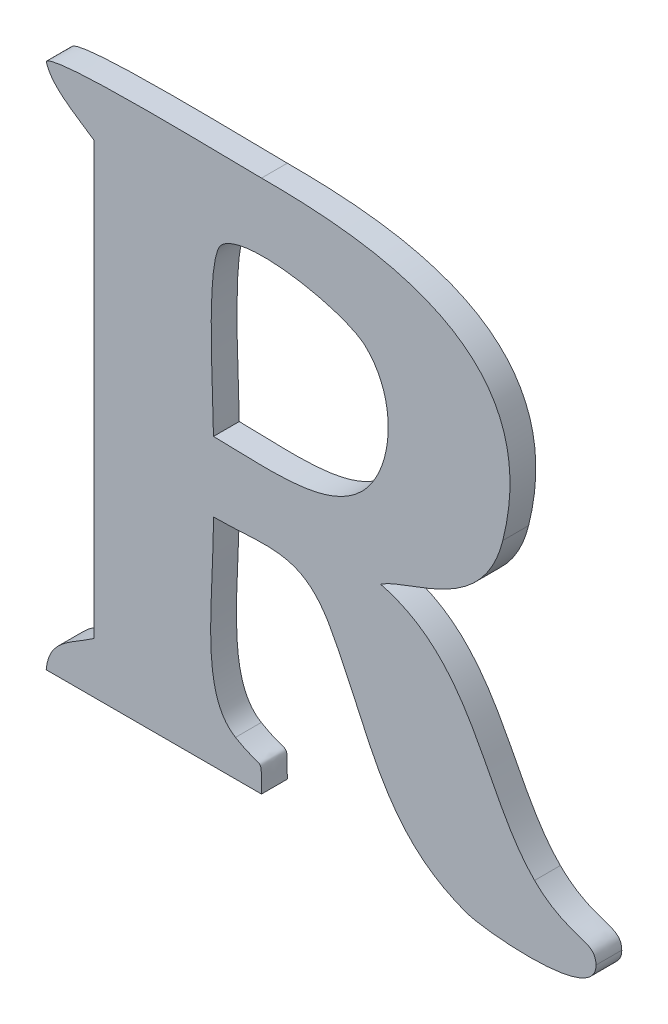
ISO-10303-21;
HEADER;
FILE_DESCRIPTION(('STEP AP214'),'2;1');
FILE_NAME('part.step','',(''),(''),'','','');
FILE_SCHEMA(('AUTOMOTIVE_DESIGN { 1 0 10303 214 1 1 1 1 }'));
ENDSEC;
DATA;
#1=APPLICATION_CONTEXT('core data for automotive mechanical design processes');
#2=APPLICATION_PROTOCOL_DEFINITION('international standard','automotive_design',2000,#1);
#3=PRODUCT_CONTEXT('',#1,'mechanical');
#4=PRODUCT('Part','Part','',(#3));
#5=PRODUCT_RELATED_PRODUCT_CATEGORY('part','',(#4));
#6=PRODUCT_DEFINITION_FORMATION('','',#4);
#7=PRODUCT_DEFINITION_CONTEXT('part definition',#1,'design');
#8=PRODUCT_DEFINITION('design','',#6,#7);
#9=PRODUCT_DEFINITION_SHAPE('','',#8);
#10=(LENGTH_UNIT() NAMED_UNIT(*) SI_UNIT(.MILLI.,.METRE.));
#11=(NAMED_UNIT(*) PLANE_ANGLE_UNIT() SI_UNIT($,.RADIAN.));
#12=(NAMED_UNIT(*) SI_UNIT($,.STERADIAN.) SOLID_ANGLE_UNIT());
#13=UNCERTAINTY_MEASURE_WITH_UNIT(LENGTH_MEASURE(1.E-05),#10,'distance_accuracy_value','');
#14=(GEOMETRIC_REPRESENTATION_CONTEXT(3) GLOBAL_UNCERTAINTY_ASSIGNED_CONTEXT((#13)) GLOBAL_UNIT_ASSIGNED_CONTEXT((#10,
#11,#12)) REPRESENTATION_CONTEXT('',''));
#15=CARTESIAN_POINT('',(0.,0.,0.));
#16=DIRECTION('',(0.,0.,1.));
#17=DIRECTION('',(1.,0.,0.));
#18=AXIS2_PLACEMENT_3D('',#15,#16,#17);
#19=CARTESIAN_POINT('',(50.2016439999998,11.212435,0.001));
#20=CARTESIAN_POINT('',(50.2016439999998,11.212435,0.));
#21=CARTESIAN_POINT('',(50.2033939999998,11.219393,0.001));
#22=CARTESIAN_POINT('',(50.2033939999998,11.219393,0.));
#23=CARTESIAN_POINT('',(50.1965339999998,11.219925,0.001));
#24=CARTESIAN_POINT('',(50.1965339999998,11.219925,0.));
#25=CARTESIAN_POINT('',(50.1922919999998,11.219925,0.001));
#26=CARTESIAN_POINT('',(50.1922919999998,11.219925,0.));
#27=B_SPLINE_SURFACE_WITH_KNOTS('',3,1,((#19,#20),(#21,#22),(#23,#24),(#25,#26)),.UNSPECIFIED.,
.F.,.F.,.F.,(4,4),(2,2),(0.8,0.866666666666667),(0.,1.),.UNSPECIFIED.);
#28=CARTESIAN_POINT('',(50.2016439999998,11.212435,0.));
#29=CARTESIAN_POINT('',(50.2033939999998,11.219393,0.));
#30=CARTESIAN_POINT('',(50.1965339999998,11.219925,0.));
#31=CARTESIAN_POINT('',(50.1922919999998,11.219925,0.));
#32=B_SPLINE_CURVE_WITH_KNOTS('',3,(#28,#29,#30,#31),.UNSPECIFIED.,.F.,.F.,(4,4),(0.8,
0.866666666666667),.UNSPECIFIED.);
#33=CARTESIAN_POINT('',(50.2016439999998,11.212435,0.));
#34=VERTEX_POINT('',#33);
#35=CARTESIAN_POINT('',(50.1922919999998,11.219925,0.));
#36=VERTEX_POINT('',#35);
#37=EDGE_CURVE('E11',#34,#36,#32,.T.);
#38=DIRECTION('',(0.,0.,-1.));
#39=VECTOR('',#38,1.);
#40=CARTESIAN_POINT('',(50.1922919999998,11.219925,0.001));
#41=LINE('',#40,#39);
#42=CARTESIAN_POINT('',(50.1922919999998,11.219925,0.001));
#43=VERTEX_POINT('',#42);
#44=EDGE_CURVE('E28',#43,#36,#41,.T.);
#45=CARTESIAN_POINT('',(50.2016439999998,11.212435,0.001));
#46=CARTESIAN_POINT('',(50.2033939999998,11.219393,0.001));
#47=CARTESIAN_POINT('',(50.1965339999998,11.219925,0.001));
#48=CARTESIAN_POINT('',(50.1922919999998,11.219925,0.001));
#49=B_SPLINE_CURVE_WITH_KNOTS('',3,(#45,#46,#47,#48),.UNSPECIFIED.,.F.,.F.,(4,4),(0.8,
0.866666666666667),.UNSPECIFIED.);
#50=CARTESIAN_POINT('',(50.2016439999998,11.212435,0.001));
#51=VERTEX_POINT('',#50);
#52=EDGE_CURVE('E420',#51,#43,#49,.T.);
#53=DIRECTION('',(0.,0.,-1.));
#54=VECTOR('',#53,1.);
#55=CARTESIAN_POINT('',(50.2016439999998,11.212435,0.001));
#56=LINE('',#55,#54);
#57=EDGE_CURVE('E40',#51,#34,#56,.T.);
#58=ORIENTED_EDGE('',*,*,#37,.T.);
#59=ORIENTED_EDGE('',*,*,#44,.F.);
#60=ORIENTED_EDGE('',*,*,#52,.F.);
#61=ORIENTED_EDGE('',*,*,#57,.T.);
#62=EDGE_LOOP('',(#58,#59,#60,#61));
#63=FACE_BOUND('',#62,.T.);
#64=ADVANCED_FACE('F17',(#63),#27,.F.);
#65=CARTESIAN_POINT('',(50.1922919999998,11.219925,0.001));
#66=CARTESIAN_POINT('',(50.1922919999998,11.219925,0.));
#67=CARTESIAN_POINT('',(50.1910599999998,11.219925,0.001));
#68=CARTESIAN_POINT('',(50.1910599999998,11.219925,0.));
#69=CARTESIAN_POINT('',(50.1843539999998,11.220135,0.001));
#70=CARTESIAN_POINT('',(50.1843539999998,11.220135,0.));
#71=CARTESIAN_POINT('',(50.1839479999998,11.219673,0.001));
#72=CARTESIAN_POINT('',(50.1839479999998,11.219673,0.));
#73=B_SPLINE_SURFACE_WITH_KNOTS('',3,1,((#65,#66),(#67,#68),(#69,#70),(#71,#72)),.UNSPECIFIED.,
.F.,.F.,.F.,(4,4),(2,2),(0.866666666666667,1.),(0.,1.),.UNSPECIFIED.);
#74=CARTESIAN_POINT('',(50.1922919999998,11.219925,0.));
#75=CARTESIAN_POINT('',(50.1910599999998,11.219925,0.));
#76=CARTESIAN_POINT('',(50.1843539999998,11.220135,0.));
#77=CARTESIAN_POINT('',(50.1839479999998,11.219673,0.));
#78=B_SPLINE_CURVE_WITH_KNOTS('',3,(#74,#75,#76,#77),.UNSPECIFIED.,.F.,.F.,(4,4),
(0.866666666666667,1.),.UNSPECIFIED.);
#79=CARTESIAN_POINT('',(50.1839479999998,11.219673,0.));
#80=VERTEX_POINT('',#79);
#81=EDGE_CURVE('E412',#36,#80,#78,.T.);
#82=DIRECTION('',(0.,0.,-1.));
#83=VECTOR('',#82,1.);
#84=CARTESIAN_POINT('',(50.1839479999998,11.219673,0.001));
#85=LINE('',#84,#83);
#86=CARTESIAN_POINT('',(50.1839479999998,11.219673,0.001));
#87=VERTEX_POINT('',#86);
#88=EDGE_CURVE('E407',#87,#80,#85,.T.);
#89=CARTESIAN_POINT('',(50.1922919999998,11.219925,0.001));
#90=CARTESIAN_POINT('',(50.1910599999998,11.219925,0.001));
#91=CARTESIAN_POINT('',(50.1843539999998,11.220135,0.001));
#92=CARTESIAN_POINT('',(50.1839479999998,11.219673,0.001));
#93=B_SPLINE_CURVE_WITH_KNOTS('',3,(#89,#90,#91,#92),.UNSPECIFIED.,.F.,.F.,(4,4),
(0.866666666666667,1.),.UNSPECIFIED.);
#94=EDGE_CURVE('E400',#43,#87,#93,.T.);
#95=ORIENTED_EDGE('',*,*,#81,.T.);
#96=ORIENTED_EDGE('',*,*,#88,.F.);
#97=ORIENTED_EDGE('',*,*,#94,.F.);
#98=ORIENTED_EDGE('',*,*,#44,.T.);
#99=EDGE_LOOP('',(#95,#96,#97,#98));
#100=FACE_BOUND('',#99,.T.);
#101=ADVANCED_FACE('F430',(#100),#73,.F.);
#102=CARTESIAN_POINT('',(50.1839479999998,11.219673,0.001));
#103=CARTESIAN_POINT('',(50.1839479999998,11.219673,0.));
#104=CARTESIAN_POINT('',(50.1841439999998,11.218931,0.001));
#105=CARTESIAN_POINT('',(50.1841439999998,11.218931,0.));
#106=CARTESIAN_POINT('',(50.1851659999998,11.218399,0.001));
#107=CARTESIAN_POINT('',(50.1851659999998,11.218399,0.));
#108=CARTESIAN_POINT('',(50.1857959999998,11.217951,0.001));
#109=CARTESIAN_POINT('',(50.1857959999998,11.217951,0.));
#110=B_SPLINE_SURFACE_WITH_KNOTS('',3,1,((#102,#103),(#104,#105),(#106,#107),(#108,#109)),
.UNSPECIFIED.,.F.,.F.,.F.,(4,4),(2,2),(0.,0.0666666666666667),(0.,1.),.UNSPECIFIED.);
#111=CARTESIAN_POINT('',(50.1839479999998,11.219673,0.));
#112=CARTESIAN_POINT('',(50.1841439999998,11.218931,0.));
#113=CARTESIAN_POINT('',(50.1851659999998,11.218399,0.));
#114=CARTESIAN_POINT('',(50.1857959999998,11.217951,0.));
#115=B_SPLINE_CURVE_WITH_KNOTS('',3,(#111,#112,#113,#114),.UNSPECIFIED.,.F.,.F.,(4,4),(0.,
0.0666666666666667),.UNSPECIFIED.);
#116=CARTESIAN_POINT('',(50.1857959999998,11.217951,0.));
#117=VERTEX_POINT('',#116);
#118=EDGE_CURVE('E395',#80,#117,#115,.T.);
#119=DIRECTION('',(0.,0.,-1.));
#120=VECTOR('',#119,1.);
#121=CARTESIAN_POINT('',(50.1857959999998,11.217951,0.001));
#122=LINE('',#121,#120);
#123=CARTESIAN_POINT('',(50.1857959999998,11.217951,0.001));
#124=VERTEX_POINT('',#123);
#125=EDGE_CURVE('E390',#124,#117,#122,.T.);
#126=CARTESIAN_POINT('',(50.1839479999998,11.219673,0.001));
#127=CARTESIAN_POINT('',(50.1841439999998,11.218931,0.001));
#128=CARTESIAN_POINT('',(50.1851659999998,11.218399,0.001));
#129=CARTESIAN_POINT('',(50.1857959999998,11.217951,0.001));
#130=B_SPLINE_CURVE_WITH_KNOTS('',3,(#126,#127,#128,#129),.UNSPECIFIED.,.F.,.F.,(4,4),(0.,
0.0666666666666667),.UNSPECIFIED.);
#131=EDGE_CURVE('E386',#87,#124,#130,.T.);
#132=ORIENTED_EDGE('',*,*,#118,.T.);
#133=ORIENTED_EDGE('',*,*,#125,.F.);
#134=ORIENTED_EDGE('',*,*,#131,.F.);
#135=ORIENTED_EDGE('',*,*,#88,.T.);
#136=EDGE_LOOP('',(#132,#133,#134,#135));
#137=FACE_BOUND('',#136,.T.);
#138=ADVANCED_FACE('F435',(#137),#110,.F.);
#139=CARTESIAN_POINT('',(50.1857959999998,0.,0.001));
#140=DIRECTION('',(1.,0.,0.));
#141=DIRECTION('',(0.,0.,-1.));
#142=AXIS2_PLACEMENT_3D('',#139,#140,#141);
#143=PLANE('',#142);
#144=DIRECTION('',(0.,-1.,0.));
#145=VECTOR('',#144,1.);
#146=CARTESIAN_POINT('',(50.1857959999998,0.,0.));
#147=LINE('',#146,#145);
#148=CARTESIAN_POINT('',(50.1857959999998,11.201221,0.));
#149=VERTEX_POINT('',#148);
#150=EDGE_CURVE('E384',#117,#149,#147,.T.);
#151=ORIENTED_EDGE('',*,*,#150,.T.);
#152=DIRECTION('',(0.,0.,-1.));
#153=VECTOR('',#152,1.);
#154=CARTESIAN_POINT('',(50.1857959999998,11.201221,0.001));
#155=LINE('',#154,#153);
#156=CARTESIAN_POINT('',(50.1857959999998,11.201221,0.001));
#157=VERTEX_POINT('',#156);
#158=EDGE_CURVE('E381',#157,#149,#155,.T.);
#159=ORIENTED_EDGE('',*,*,#158,.F.);
#160=DIRECTION('',(0.,-1.,0.));
#161=VECTOR('',#160,1.);
#162=CARTESIAN_POINT('',(50.1857959999998,0.,0.001));
#163=LINE('',#162,#161);
#164=EDGE_CURVE('E375',#124,#157,#163,.T.);
#165=ORIENTED_EDGE('',*,*,#164,.F.);
#166=ORIENTED_EDGE('',*,*,#125,.T.);
#167=EDGE_LOOP('',(#151,#159,#165,#166));
#168=FACE_BOUND('',#167,.T.);
#169=ADVANCED_FACE('F493',(#168),#143,.F.);
#170=CARTESIAN_POINT('',(50.1857959999998,11.201221,0.001));
#171=CARTESIAN_POINT('',(50.1857959999998,11.201221,0.));
#172=CARTESIAN_POINT('',(50.1849839999998,11.200647,0.001));
#173=CARTESIAN_POINT('',(50.1849839999998,11.200647,0.));
#174=CARTESIAN_POINT('',(50.1840459999998,11.200395,0.001));
#175=CARTESIAN_POINT('',(50.1840459999998,11.200395,0.));
#176=CARTESIAN_POINT('',(50.1839479999998,11.199247,0.001));
#177=CARTESIAN_POINT('',(50.1839479999998,11.199247,0.));
#178=B_SPLINE_SURFACE_WITH_KNOTS('',3,1,((#170,#171),(#172,#173),(#174,#175),(#176,#177)),
.UNSPECIFIED.,.F.,.F.,.F.,(4,4),(2,2),(0.133333333333333,0.2),(0.,1.),.UNSPECIFIED.);
#179=CARTESIAN_POINT('',(50.1857959999998,11.201221,0.));
#180=CARTESIAN_POINT('',(50.1849839999998,11.200647,0.));
#181=CARTESIAN_POINT('',(50.1840459999998,11.200395,0.));
#182=CARTESIAN_POINT('',(50.1839479999998,11.199247,0.));
#183=B_SPLINE_CURVE_WITH_KNOTS('',3,(#179,#180,#181,#182),.UNSPECIFIED.,.F.,.F.,(4,4),
(0.133333333333333,0.2),.UNSPECIFIED.);
#184=CARTESIAN_POINT('',(50.1839479999998,11.199247,0.));
#185=VERTEX_POINT('',#184);
#186=EDGE_CURVE('E370',#149,#185,#183,.T.);
#187=DIRECTION('',(0.,0.,-1.));
#188=VECTOR('',#187,1.);
#189=CARTESIAN_POINT('',(50.1839479999998,11.199247,0.001));
#190=LINE('',#189,#188);
#191=CARTESIAN_POINT('',(50.1839479999998,11.199247,0.001));
#192=VERTEX_POINT('',#191);
#193=EDGE_CURVE('E365',#192,#185,#190,.T.);
#194=CARTESIAN_POINT('',(50.1857959999998,11.201221,0.001));
#195=CARTESIAN_POINT('',(50.1849839999998,11.200647,0.001));
#196=CARTESIAN_POINT('',(50.1840459999998,11.200395,0.001));
#197=CARTESIAN_POINT('',(50.1839479999998,11.199247,0.001));
#198=B_SPLINE_CURVE_WITH_KNOTS('',3,(#194,#195,#196,#197),.UNSPECIFIED.,.F.,.F.,(4,4),
(0.133333333333333,0.2),.UNSPECIFIED.);
#199=EDGE_CURVE('E361',#157,#192,#198,.T.);
#200=ORIENTED_EDGE('',*,*,#186,.T.);
#201=ORIENTED_EDGE('',*,*,#193,.F.);
#202=ORIENTED_EDGE('',*,*,#199,.F.);
#203=ORIENTED_EDGE('',*,*,#158,.T.);
#204=EDGE_LOOP('',(#200,#201,#202,#203));
#205=FACE_BOUND('',#204,.T.);
#206=ADVANCED_FACE('F441',(#205),#178,.F.);
#207=CARTESIAN_POINT('',(0.,11.199247,0.001));
#208=DIRECTION('',(0.,1.,0.));
#209=DIRECTION('',(0.,0.,1.));
#210=AXIS2_PLACEMENT_3D('',#207,#208,#209);
#211=PLANE('',#210);
#212=DIRECTION('',(1.,0.,0.));
#213=VECTOR('',#212,1.);
#214=CARTESIAN_POINT('',(0.,11.199247,0.));
#215=LINE('',#214,#213);
#216=CARTESIAN_POINT('',(50.1922919999998,11.199247,0.));
#217=VERTEX_POINT('',#216);
#218=EDGE_CURVE('E359',#185,#217,#215,.T.);
#219=ORIENTED_EDGE('',*,*,#218,.T.);
#220=DIRECTION('',(0.,0.,-1.));
#221=VECTOR('',#220,1.);
#222=CARTESIAN_POINT('',(50.1922919999998,11.199247,0.001));
#223=LINE('',#222,#221);
#224=CARTESIAN_POINT('',(50.1922919999998,11.199247,0.001));
#225=VERTEX_POINT('',#224);
#226=EDGE_CURVE('E356',#225,#217,#223,.T.);
#227=ORIENTED_EDGE('',*,*,#226,.F.);
#228=DIRECTION('',(1.,0.,0.));
#229=VECTOR('',#228,1.);
#230=CARTESIAN_POINT('',(0.,11.199247,0.001));
#231=LINE('',#230,#229);
#232=EDGE_CURVE('E350',#192,#225,#231,.T.);
#233=ORIENTED_EDGE('',*,*,#232,.F.);
#234=ORIENTED_EDGE('',*,*,#193,.T.);
#235=EDGE_LOOP('',(#219,#227,#233,#234));
#236=FACE_BOUND('',#235,.T.);
#237=ADVANCED_FACE('F446',(#236),#211,.F.);
#238=CARTESIAN_POINT('',(50.1922919999998,11.199247,0.001));
#239=CARTESIAN_POINT('',(50.1922919999998,11.199247,0.));
#240=CARTESIAN_POINT('',(50.1922499999998,11.200661,0.001));
#241=CARTESIAN_POINT('',(50.1922499999998,11.200661,0.));
#242=CARTESIAN_POINT('',(50.1924739999998,11.199947,0.001));
#243=CARTESIAN_POINT('',(50.1924739999998,11.199947,0.));
#244=CARTESIAN_POINT('',(50.1912839999998,11.200647,0.001));
#245=CARTESIAN_POINT('',(50.1912839999998,11.200647,0.));
#246=B_SPLINE_SURFACE_WITH_KNOTS('',3,1,((#238,#239),(#240,#241),(#242,#243),(#244,#245)),
.UNSPECIFIED.,.F.,.F.,.F.,(4,4),(2,2),(0.266666666666667,0.333333333333333),(0.,1.),.UNSPECIFIED.);
#247=CARTESIAN_POINT('',(50.1922919999998,11.199247,0.));
#248=CARTESIAN_POINT('',(50.1922499999998,11.200661,0.));
#249=CARTESIAN_POINT('',(50.1924739999998,11.199947,0.));
#250=CARTESIAN_POINT('',(50.1912839999998,11.200647,0.));
#251=B_SPLINE_CURVE_WITH_KNOTS('',3,(#247,#248,#249,#250),.UNSPECIFIED.,.F.,.F.,(4,4),
(0.266666666666667,0.333333333333333),.UNSPECIFIED.);
#252=CARTESIAN_POINT('',(50.1912839999998,11.200647,0.));
#253=VERTEX_POINT('',#252);
#254=EDGE_CURVE('E345',#217,#253,#251,.T.);
#255=DIRECTION('',(0.,0.,-1.));
#256=VECTOR('',#255,1.);
#257=CARTESIAN_POINT('',(50.1912839999998,11.200647,0.001));
#258=LINE('',#257,#256);
#259=CARTESIAN_POINT('',(50.1912839999998,11.200647,0.001));
#260=VERTEX_POINT('',#259);
#261=EDGE_CURVE('E340',#260,#253,#258,.T.);
#262=CARTESIAN_POINT('',(50.1922919999998,11.199247,0.001));
#263=CARTESIAN_POINT('',(50.1922499999998,11.200661,0.001));
#264=CARTESIAN_POINT('',(50.1924739999998,11.199947,0.001));
#265=CARTESIAN_POINT('',(50.1912839999998,11.200647,0.001));
#266=B_SPLINE_CURVE_WITH_KNOTS('',3,(#262,#263,#264,#265),.UNSPECIFIED.,.F.,.F.,(4,4),
(0.266666666666667,0.333333333333333),.UNSPECIFIED.);
#267=EDGE_CURVE('E333',#225,#260,#266,.T.);
#268=ORIENTED_EDGE('',*,*,#254,.T.);
#269=ORIENTED_EDGE('',*,*,#261,.F.);
#270=ORIENTED_EDGE('',*,*,#267,.F.);
#271=ORIENTED_EDGE('',*,*,#226,.T.);
#272=EDGE_LOOP('',(#268,#269,#270,#271));
#273=FACE_BOUND('',#272,.T.);
#274=ADVANCED_FACE('F450',(#273),#246,.F.);
#275=CARTESIAN_POINT('',(50.1912839999998,11.200647,0.001));
#276=CARTESIAN_POINT('',(50.1912839999998,11.200647,0.));
#277=CARTESIAN_POINT('',(50.1898699999998,11.201487,0.001));
#278=CARTESIAN_POINT('',(50.1898699999998,11.201487,0.));
#279=CARTESIAN_POINT('',(50.1904299999998,11.204679,0.001));
#280=CARTESIAN_POINT('',(50.1904299999998,11.204679,0.));
#281=CARTESIAN_POINT('',(50.1904299999998,11.207619,0.001));
#282=CARTESIAN_POINT('',(50.1904299999998,11.207619,0.));
#283=B_SPLINE_SURFACE_WITH_KNOTS('',3,1,((#275,#276),(#277,#278),(#279,#280),(#281,#282)),
.UNSPECIFIED.,.F.,.F.,.F.,(4,4),(2,2),(0.333333333333333,0.4),(0.,1.),.UNSPECIFIED.);
#284=CARTESIAN_POINT('',(50.1912839999998,11.200647,0.));
#285=CARTESIAN_POINT('',(50.1898699999998,11.201487,0.));
#286=CARTESIAN_POINT('',(50.1904299999998,11.204679,0.));
#287=CARTESIAN_POINT('',(50.1904299999998,11.207619,0.));
#288=B_SPLINE_CURVE_WITH_KNOTS('',3,(#284,#285,#286,#287),.UNSPECIFIED.,.F.,.F.,(4,4),
(0.333333333333333,0.4),.UNSPECIFIED.);
#289=CARTESIAN_POINT('',(50.1904299999998,11.207619,0.));
#290=VERTEX_POINT('',#289);
#291=EDGE_CURVE('E328',#253,#290,#288,.T.);
#292=DIRECTION('',(0.,0.,-1.));
#293=VECTOR('',#292,1.);
#294=CARTESIAN_POINT('',(50.1904299999998,11.207619,0.001));
#295=LINE('',#294,#293);
#296=CARTESIAN_POINT('',(50.1904299999998,11.207619,0.001));
#297=VERTEX_POINT('',#296);
#298=EDGE_CURVE('E323',#297,#290,#295,.T.);
#299=CARTESIAN_POINT('',(50.1912839999998,11.200647,0.001));
#300=CARTESIAN_POINT('',(50.1898699999998,11.201487,0.001));
#301=CARTESIAN_POINT('',(50.1904299999998,11.204679,0.001));
#302=CARTESIAN_POINT('',(50.1904299999998,11.207619,0.001));
#303=B_SPLINE_CURVE_WITH_KNOTS('',3,(#299,#300,#301,#302),.UNSPECIFIED.,.F.,.F.,(4,4),
(0.333333333333333,0.4),.UNSPECIFIED.);
#304=EDGE_CURVE('E316',#260,#297,#303,.T.);
#305=ORIENTED_EDGE('',*,*,#291,.T.);
#306=ORIENTED_EDGE('',*,*,#298,.F.);
#307=ORIENTED_EDGE('',*,*,#304,.F.);
#308=ORIENTED_EDGE('',*,*,#261,.T.);
#309=EDGE_LOOP('',(#305,#306,#307,#308));
#310=FACE_BOUND('',#309,.T.);
#311=ADVANCED_FACE('F456',(#310),#283,.F.);
#312=CARTESIAN_POINT('',(50.1904299999998,11.207619,0.001));
#313=CARTESIAN_POINT('',(50.1904299999998,11.207619,0.));
#314=CARTESIAN_POINT('',(50.1924739999998,11.207619,0.001));
#315=CARTESIAN_POINT('',(50.1924739999998,11.207619,0.));
#316=CARTESIAN_POINT('',(50.1938319999998,11.208165,0.001));
#317=CARTESIAN_POINT('',(50.1938319999998,11.208165,0.));
#318=CARTESIAN_POINT('',(50.1949239999998,11.206233,0.001));
#319=CARTESIAN_POINT('',(50.1949239999998,11.206233,0.));
#320=B_SPLINE_SURFACE_WITH_KNOTS('',3,1,((#312,#313),(#314,#315),(#316,#317),(#318,#319)),
.UNSPECIFIED.,.F.,.F.,.F.,(4,4),(2,2),(0.4,0.466666666666667),(0.,1.),.UNSPECIFIED.);
#321=CARTESIAN_POINT('',(50.1904299999998,11.207619,0.));
#322=CARTESIAN_POINT('',(50.1924739999998,11.207619,0.));
#323=CARTESIAN_POINT('',(50.1938319999998,11.208165,0.));
#324=CARTESIAN_POINT('',(50.1949239999998,11.206233,0.));
#325=B_SPLINE_CURVE_WITH_KNOTS('',3,(#321,#322,#323,#324),.UNSPECIFIED.,.F.,.F.,(4,4),(0.4,
0.466666666666667),.UNSPECIFIED.);
#326=CARTESIAN_POINT('',(50.1949239999998,11.206233,0.));
#327=VERTEX_POINT('',#326);
#328=EDGE_CURVE('E311',#290,#327,#325,.T.);
#329=DIRECTION('',(0.,0.,-1.));
#330=VECTOR('',#329,1.);
#331=CARTESIAN_POINT('',(50.1949239999998,11.206233,0.001));
#332=LINE('',#331,#330);
#333=CARTESIAN_POINT('',(50.1949239999998,11.206233,0.001));
#334=VERTEX_POINT('',#333);
#335=EDGE_CURVE('E306',#334,#327,#332,.T.);
#336=CARTESIAN_POINT('',(50.1904299999998,11.207619,0.001));
#337=CARTESIAN_POINT('',(50.1924739999998,11.207619,0.001));
#338=CARTESIAN_POINT('',(50.1938319999998,11.208165,0.001));
#339=CARTESIAN_POINT('',(50.1949239999998,11.206233,0.001));
#340=B_SPLINE_CURVE_WITH_KNOTS('',3,(#336,#337,#338,#339),.UNSPECIFIED.,.F.,.F.,(4,4),(0.4,
0.466666666666667),.UNSPECIFIED.);
#341=EDGE_CURVE('E299',#297,#334,#340,.T.);
#342=ORIENTED_EDGE('',*,*,#328,.T.);
#343=ORIENTED_EDGE('',*,*,#335,.F.);
#344=ORIENTED_EDGE('',*,*,#341,.F.);
#345=ORIENTED_EDGE('',*,*,#298,.T.);
#346=EDGE_LOOP('',(#342,#343,#344,#345));
#347=FACE_BOUND('',#346,.T.);
#348=ADVANCED_FACE('F462',(#347),#320,.F.);
#349=CARTESIAN_POINT('',(50.1949239999998,11.206233,0.001));
#350=CARTESIAN_POINT('',(50.1949239999998,11.206233,0.));
#351=CARTESIAN_POINT('',(50.1965059999998,11.203419,0.001));
#352=CARTESIAN_POINT('',(50.1965059999998,11.203419,0.));
#353=CARTESIAN_POINT('',(50.1969819999998,11.200339,0.001));
#354=CARTESIAN_POINT('',(50.1969819999998,11.200339,0.));
#355=CARTESIAN_POINT('',(50.2003419999998,11.199205,0.001));
#356=CARTESIAN_POINT('',(50.2003419999998,11.199205,0.));
#357=B_SPLINE_SURFACE_WITH_KNOTS('',3,1,((#349,#350),(#351,#352),(#353,#354),(#355,#356)),
.UNSPECIFIED.,.F.,.F.,.F.,(4,4),(2,2),(0.466666666666667,0.533333333333333),(0.,1.),.UNSPECIFIED.);
#358=CARTESIAN_POINT('',(50.1949239999998,11.206233,0.));
#359=CARTESIAN_POINT('',(50.1965059999998,11.203419,0.));
#360=CARTESIAN_POINT('',(50.1969819999998,11.200339,0.));
#361=CARTESIAN_POINT('',(50.2003419999998,11.199205,0.));
#362=B_SPLINE_CURVE_WITH_KNOTS('',3,(#358,#359,#360,#361),.UNSPECIFIED.,.F.,.F.,(4,4),
(0.466666666666667,0.533333333333333),.UNSPECIFIED.);
#363=CARTESIAN_POINT('',(50.2003419999998,11.199205,0.));
#364=VERTEX_POINT('',#363);
#365=EDGE_CURVE('E294',#327,#364,#362,.T.);
#366=DIRECTION('',(0.,0.,-1.));
#367=VECTOR('',#366,1.);
#368=CARTESIAN_POINT('',(50.2003419999998,11.199205,0.001));
#369=LINE('',#368,#367);
#370=CARTESIAN_POINT('',(50.2003419999998,11.199205,0.001));
#371=VERTEX_POINT('',#370);
#372=EDGE_CURVE('E289',#371,#364,#369,.T.);
#373=CARTESIAN_POINT('',(50.1949239999998,11.206233,0.001));
#374=CARTESIAN_POINT('',(50.1965059999998,11.203419,0.001));
#375=CARTESIAN_POINT('',(50.1969819999998,11.200339,0.001));
#376=CARTESIAN_POINT('',(50.2003419999998,11.199205,0.001));
#377=B_SPLINE_CURVE_WITH_KNOTS('',3,(#373,#374,#375,#376),.UNSPECIFIED.,.F.,.F.,(4,4),
(0.466666666666667,0.533333333333333),.UNSPECIFIED.);
#378=EDGE_CURVE('E282',#334,#371,#377,.T.);
#379=ORIENTED_EDGE('',*,*,#365,.T.);
#380=ORIENTED_EDGE('',*,*,#372,.F.);
#381=ORIENTED_EDGE('',*,*,#378,.F.);
#382=ORIENTED_EDGE('',*,*,#335,.T.);
#383=EDGE_LOOP('',(#379,#380,#381,#382));
#384=FACE_BOUND('',#383,.T.);
#385=ADVANCED_FACE('F466',(#384),#357,.F.);
#386=CARTESIAN_POINT('',(50.2003419999998,11.199205,0.001));
#387=CARTESIAN_POINT('',(50.2003419999998,11.199205,0.));
#388=CARTESIAN_POINT('',(50.2009719999998,11.198995,0.001));
#389=CARTESIAN_POINT('',(50.2009719999998,11.198995,0.));
#390=CARTESIAN_POINT('',(50.2052699999998,11.198547,0.001));
#391=CARTESIAN_POINT('',(50.2052699999998,11.198547,0.));
#392=CARTESIAN_POINT('',(50.2052559999998,11.199989,0.001));
#393=CARTESIAN_POINT('',(50.2052559999998,11.199989,0.));
#394=B_SPLINE_SURFACE_WITH_KNOTS('',3,1,((#386,#387),(#388,#389),(#390,#391),(#392,#393)),
.UNSPECIFIED.,.F.,.F.,.F.,(4,4),(2,2),(0.533333333333333,0.6),(0.,1.),.UNSPECIFIED.);
#395=CARTESIAN_POINT('',(50.2003419999998,11.199205,0.));
#396=CARTESIAN_POINT('',(50.2009719999998,11.198995,0.));
#397=CARTESIAN_POINT('',(50.2052699999998,11.198547,0.));
#398=CARTESIAN_POINT('',(50.2052559999998,11.199989,0.));
#399=B_SPLINE_CURVE_WITH_KNOTS('',3,(#395,#396,#397,#398),.UNSPECIFIED.,.F.,.F.,(4,4),
(0.533333333333333,0.6),.UNSPECIFIED.);
#400=CARTESIAN_POINT('',(50.2052559999998,11.199989,0.));
#401=VERTEX_POINT('',#400);
#402=EDGE_CURVE('E277',#364,#401,#399,.T.);
#403=DIRECTION('',(0.,0.,-1.));
#404=VECTOR('',#403,1.);
#405=CARTESIAN_POINT('',(50.2052559999998,11.199989,0.001));
#406=LINE('',#405,#404);
#407=CARTESIAN_POINT('',(50.2052559999998,11.199989,0.001));
#408=VERTEX_POINT('',#407);
#409=EDGE_CURVE('E272',#408,#401,#406,.T.);
#410=CARTESIAN_POINT('',(50.2003419999998,11.199205,0.001));
#411=CARTESIAN_POINT('',(50.2009719999998,11.198995,0.001));
#412=CARTESIAN_POINT('',(50.2052699999998,11.198547,0.001));
#413=CARTESIAN_POINT('',(50.2052559999998,11.199989,0.001));
#414=B_SPLINE_CURVE_WITH_KNOTS('',3,(#410,#411,#412,#413),.UNSPECIFIED.,.F.,.F.,(4,4),
(0.533333333333333,0.6),.UNSPECIFIED.);
#415=EDGE_CURVE('E265',#371,#408,#414,.T.);
#416=ORIENTED_EDGE('',*,*,#402,.T.);
#417=ORIENTED_EDGE('',*,*,#409,.F.);
#418=ORIENTED_EDGE('',*,*,#415,.F.);
#419=ORIENTED_EDGE('',*,*,#372,.T.);
#420=EDGE_LOOP('',(#416,#417,#418,#419));
#421=FACE_BOUND('',#420,.T.);
#422=ADVANCED_FACE('F471',(#421),#394,.F.);
#423=CARTESIAN_POINT('',(50.2052559999998,11.199989,0.001));
#424=CARTESIAN_POINT('',(50.2052559999998,11.199989,0.));
#425=CARTESIAN_POINT('',(50.2052419999998,11.200843,0.001));
#426=CARTESIAN_POINT('',(50.2052419999998,11.200843,0.));
#427=CARTESIAN_POINT('',(50.2041779999998,11.200353,0.001));
#428=CARTESIAN_POINT('',(50.2041779999998,11.200353,0.));
#429=CARTESIAN_POINT('',(50.2028759999998,11.201641,0.001));
#430=CARTESIAN_POINT('',(50.2028759999998,11.201641,0.));
#431=B_SPLINE_SURFACE_WITH_KNOTS('',3,1,((#423,#424),(#425,#426),(#427,#428),(#429,#430)),
.UNSPECIFIED.,.F.,.F.,.F.,(4,4),(2,2),(0.6,0.666666666666667),(0.,1.),.UNSPECIFIED.);
#432=CARTESIAN_POINT('',(50.2052559999998,11.199989,0.));
#433=CARTESIAN_POINT('',(50.2052419999998,11.200843,0.));
#434=CARTESIAN_POINT('',(50.2041779999998,11.200353,0.));
#435=CARTESIAN_POINT('',(50.2028759999998,11.201641,0.));
#436=B_SPLINE_CURVE_WITH_KNOTS('',3,(#432,#433,#434,#435),.UNSPECIFIED.,.F.,.F.,(4,4),(0.6,
0.666666666666667),.UNSPECIFIED.);
#437=CARTESIAN_POINT('',(50.2028759999998,11.201641,0.));
#438=VERTEX_POINT('',#437);
#439=EDGE_CURVE('E260',#401,#438,#436,.T.);
#440=DIRECTION('',(0.,0.,-1.));
#441=VECTOR('',#440,1.);
#442=CARTESIAN_POINT('',(50.2028759999998,11.201641,0.001));
#443=LINE('',#442,#441);
#444=CARTESIAN_POINT('',(50.2028759999998,11.201641,0.001));
#445=VERTEX_POINT('',#444);
#446=EDGE_CURVE('E255',#445,#438,#443,.T.);
#447=CARTESIAN_POINT('',(50.2052559999998,11.199989,0.001));
#448=CARTESIAN_POINT('',(50.2052419999998,11.200843,0.001));
#449=CARTESIAN_POINT('',(50.2041779999998,11.200353,0.001));
#450=CARTESIAN_POINT('',(50.2028759999998,11.201641,0.001));
#451=B_SPLINE_CURVE_WITH_KNOTS('',3,(#447,#448,#449,#450),.UNSPECIFIED.,.F.,.F.,(4,4),(0.6,
0.666666666666667),.UNSPECIFIED.);
#452=EDGE_CURVE('E248',#408,#445,#451,.T.);
#453=ORIENTED_EDGE('',*,*,#439,.T.);
#454=ORIENTED_EDGE('',*,*,#446,.F.);
#455=ORIENTED_EDGE('',*,*,#452,.F.);
#456=ORIENTED_EDGE('',*,*,#409,.T.);
#457=EDGE_LOOP('',(#453,#454,#455,#456));
#458=FACE_BOUND('',#457,.T.);
#459=ADVANCED_FACE('F477',(#458),#431,.F.);
#460=CARTESIAN_POINT('',(50.2028759999998,11.201641,0.001));
#461=CARTESIAN_POINT('',(50.2028759999998,11.201641,0.));
#462=CARTESIAN_POINT('',(50.2008879999998,11.203615,0.001));
#463=CARTESIAN_POINT('',(50.2008879999998,11.203615,0.));
#464=CARTESIAN_POINT('',(50.2005099999998,11.207689,0.001));
#465=CARTESIAN_POINT('',(50.2005099999998,11.207689,0.));
#466=CARTESIAN_POINT('',(50.1969119999998,11.208599,0.001));
#467=CARTESIAN_POINT('',(50.1969119999998,11.208599,0.));
#468=B_SPLINE_SURFACE_WITH_KNOTS('',3,1,((#460,#461),(#462,#463),(#464,#465),(#466,#467)),
.UNSPECIFIED.,.F.,.F.,.F.,(4,4),(2,2),(0.666666666666667,0.733333333333333),(0.,1.),.UNSPECIFIED.);
#469=CARTESIAN_POINT('',(50.2028759999998,11.201641,0.));
#470=CARTESIAN_POINT('',(50.2008879999998,11.203615,0.));
#471=CARTESIAN_POINT('',(50.2005099999998,11.207689,0.));
#472=CARTESIAN_POINT('',(50.1969119999998,11.208599,0.));
#473=B_SPLINE_CURVE_WITH_KNOTS('',3,(#469,#470,#471,#472),.UNSPECIFIED.,.F.,.F.,(4,4),
(0.666666666666667,0.733333333333333),.UNSPECIFIED.);
#474=CARTESIAN_POINT('',(50.1969119999998,11.208599,0.));
#475=VERTEX_POINT('',#474);
#476=EDGE_CURVE('E243',#438,#475,#473,.T.);
#477=DIRECTION('',(0.,0.,-1.));
#478=VECTOR('',#477,1.);
#479=CARTESIAN_POINT('',(50.1969119999998,11.208599,0.001));
#480=LINE('',#479,#478);
#481=CARTESIAN_POINT('',(50.1969119999998,11.208599,0.001));
#482=VERTEX_POINT('',#481);
#483=EDGE_CURVE('E238',#482,#475,#480,.T.);
#484=CARTESIAN_POINT('',(50.2028759999998,11.201641,0.001));
#485=CARTESIAN_POINT('',(50.2008879999998,11.203615,0.001));
#486=CARTESIAN_POINT('',(50.2005099999998,11.207689,0.001));
#487=CARTESIAN_POINT('',(50.1969119999998,11.208599,0.001));
#488=B_SPLINE_CURVE_WITH_KNOTS('',3,(#484,#485,#486,#487),.UNSPECIFIED.,.F.,.F.,(4,4),
(0.666666666666667,0.733333333333333),.UNSPECIFIED.);
#489=EDGE_CURVE('E231',#445,#482,#488,.T.);
#490=ORIENTED_EDGE('',*,*,#476,.T.);
#491=ORIENTED_EDGE('',*,*,#483,.F.);
#492=ORIENTED_EDGE('',*,*,#489,.F.);
#493=ORIENTED_EDGE('',*,*,#446,.T.);
#494=EDGE_LOOP('',(#490,#491,#492,#493));
#495=FACE_BOUND('',#494,.T.);
#496=ADVANCED_FACE('F481',(#495),#468,.F.);
#497=CARTESIAN_POINT('',(50.1962959999998,11.216313,0.001));
#498=CARTESIAN_POINT('',(50.1962959999998,11.216313,0.));
#499=CARTESIAN_POINT('',(50.1975979999998,11.215137,0.001));
#500=CARTESIAN_POINT('',(50.1975979999998,11.215137,0.));
#501=CARTESIAN_POINT('',(50.1974439999998,11.212617,0.001));
#502=CARTESIAN_POINT('',(50.1974439999998,11.212617,0.));
#503=CARTESIAN_POINT('',(50.1961839999998,11.211357,0.001));
#504=CARTESIAN_POINT('',(50.1961839999998,11.211357,0.));
#505=B_SPLINE_SURFACE_WITH_KNOTS('',3,1,((#497,#498),(#499,#500),(#501,#502),(#503,#504)),
.UNSPECIFIED.,.F.,.F.,.F.,(4,4),(2,2),(0.4,0.6),(0.,1.),.UNSPECIFIED.);
#506=CARTESIAN_POINT('',(50.1962959999998,11.216313,0.));
#507=CARTESIAN_POINT('',(50.1975979999998,11.215137,0.));
#508=CARTESIAN_POINT('',(50.1974439999998,11.212617,0.));
#509=CARTESIAN_POINT('',(50.1961839999998,11.211357,0.));
#510=B_SPLINE_CURVE_WITH_KNOTS('',3,(#506,#507,#508,#509),.UNSPECIFIED.,.F.,.F.,(4,4),(0.4,0.6),.UNSPECIFIED.);
#511=CARTESIAN_POINT('',(50.1962959999998,11.216313,0.));
#512=VERTEX_POINT('',#511);
#513=CARTESIAN_POINT('',(50.1961839999998,11.211357,0.));
#514=VERTEX_POINT('',#513);
#515=EDGE_CURVE('E226',#512,#514,#510,.T.);
#516=DIRECTION('',(0.,0.,-1.));
#517=VECTOR('',#516,1.);
#518=CARTESIAN_POINT('',(50.1961839999998,11.211357,0.001));
#519=LINE('',#518,#517);
#520=CARTESIAN_POINT('',(50.1961839999998,11.211357,0.001));
#521=VERTEX_POINT('',#520);
#522=EDGE_CURVE('E221',#521,#514,#519,.T.);
#523=CARTESIAN_POINT('',(50.1962959999998,11.216313,0.001));
#524=CARTESIAN_POINT('',(50.1975979999998,11.215137,0.001));
#525=CARTESIAN_POINT('',(50.1974439999998,11.212617,0.001));
#526=CARTESIAN_POINT('',(50.1961839999998,11.211357,0.001));
#527=B_SPLINE_CURVE_WITH_KNOTS('',3,(#523,#524,#525,#526),.UNSPECIFIED.,.F.,.F.,(4,4),(0.4,0.6),.UNSPECIFIED.);
#528=CARTESIAN_POINT('',(50.1962959999998,11.216313,0.001));
#529=VERTEX_POINT('',#528);
#530=EDGE_CURVE('E217',#529,#521,#527,.T.);
#531=DIRECTION('',(0.,0.,-1.));
#532=VECTOR('',#531,1.);
#533=CARTESIAN_POINT('',(50.1962959999998,11.216313,0.001));
#534=LINE('',#533,#532);
#535=EDGE_CURVE('E167',#529,#512,#534,.T.);
#536=ORIENTED_EDGE('',*,*,#515,.T.);
#537=ORIENTED_EDGE('',*,*,#522,.F.);
#538=ORIENTED_EDGE('',*,*,#530,.F.);
#539=ORIENTED_EDGE('',*,*,#535,.T.);
#540=EDGE_LOOP('',(#536,#537,#538,#539));
#541=FACE_BOUND('',#540,.T.);
#542=ADVANCED_FACE('F607',(#541),#505,.F.);
#543=CARTESIAN_POINT('',(50.1961839999998,11.211357,0.001));
#544=CARTESIAN_POINT('',(50.1961839999998,11.211357,0.));
#545=CARTESIAN_POINT('',(50.1947839999998,11.209957,0.001));
#546=CARTESIAN_POINT('',(50.1947839999998,11.209957,0.));
#547=CARTESIAN_POINT('',(50.1923759999998,11.210321,0.001));
#548=CARTESIAN_POINT('',(50.1923759999998,11.210321,0.));
#549=CARTESIAN_POINT('',(50.1904299999998,11.210321,0.001));
#550=CARTESIAN_POINT('',(50.1904299999998,11.210321,0.));
#551=B_SPLINE_SURFACE_WITH_KNOTS('',3,1,((#543,#544),(#545,#546),(#547,#548),(#549,#550)),
.UNSPECIFIED.,.F.,.F.,.F.,(4,4),(2,2),(0.6,1.),(0.,1.),.UNSPECIFIED.);
#552=CARTESIAN_POINT('',(50.1961839999998,11.211357,0.));
#553=CARTESIAN_POINT('',(50.1947839999998,11.209957,0.));
#554=CARTESIAN_POINT('',(50.1923759999998,11.210321,0.));
#555=CARTESIAN_POINT('',(50.1904299999998,11.210321,0.));
#556=B_SPLINE_CURVE_WITH_KNOTS('',3,(#552,#553,#554,#555),.UNSPECIFIED.,.F.,.F.,(4,4),(0.6,1.),.UNSPECIFIED.);
#557=CARTESIAN_POINT('',(50.1904299999998,11.210321,0.));
#558=VERTEX_POINT('',#557);
#559=EDGE_CURVE('E208',#514,#558,#556,.T.);
#560=DIRECTION('',(0.,0.,-1.));
#561=VECTOR('',#560,1.);
#562=CARTESIAN_POINT('',(50.1904299999998,11.210321,0.001));
#563=LINE('',#562,#561);
#564=CARTESIAN_POINT('',(50.1904299999998,11.210321,0.001));
#565=VERTEX_POINT('',#564);
#566=EDGE_CURVE('E203',#565,#558,#563,.T.);
#567=CARTESIAN_POINT('',(50.1961839999998,11.211357,0.001));
#568=CARTESIAN_POINT('',(50.1947839999998,11.209957,0.001));
#569=CARTESIAN_POINT('',(50.1923759999998,11.210321,0.001));
#570=CARTESIAN_POINT('',(50.1904299999998,11.210321,0.001));
#571=B_SPLINE_CURVE_WITH_KNOTS('',3,(#567,#568,#569,#570),.UNSPECIFIED.,.F.,.F.,(4,4),(0.6,1.),.UNSPECIFIED.);
#572=EDGE_CURVE('E152',#521,#565,#571,.T.);
#573=ORIENTED_EDGE('',*,*,#559,.T.);
#574=ORIENTED_EDGE('',*,*,#566,.F.);
#575=ORIENTED_EDGE('',*,*,#572,.F.);
#576=ORIENTED_EDGE('',*,*,#522,.T.);
#577=EDGE_LOOP('',(#573,#574,#575,#576));
#578=FACE_BOUND('',#577,.T.);
#579=ADVANCED_FACE('F616',(#578),#551,.F.);
#580=CARTESIAN_POINT('',(50.1904299999998,11.210321,0.001));
#581=CARTESIAN_POINT('',(50.1904299999998,11.210321,0.));
#582=CARTESIAN_POINT('',(50.1904299999998,11.211511,0.001));
#583=CARTESIAN_POINT('',(50.1904299999998,11.211511,0.));
#584=CARTESIAN_POINT('',(50.1900939999998,11.216271,0.001));
#585=CARTESIAN_POINT('',(50.1900939999998,11.216271,0.));
#586=CARTESIAN_POINT('',(50.1907379999998,11.216901,0.001));
#587=CARTESIAN_POINT('',(50.1907379999998,11.216901,0.));
#588=B_SPLINE_SURFACE_WITH_KNOTS('',3,1,((#580,#581),(#582,#583),(#584,#585),(#586,#587)),
.UNSPECIFIED.,.F.,.F.,.F.,(4,4),(2,2),(0.,0.2),(0.,1.),.UNSPECIFIED.);
#589=CARTESIAN_POINT('',(50.1904299999998,11.210321,0.));
#590=CARTESIAN_POINT('',(50.1904299999998,11.211511,0.));
#591=CARTESIAN_POINT('',(50.1900939999998,11.216271,0.));
#592=CARTESIAN_POINT('',(50.1907379999998,11.216901,0.));
#593=B_SPLINE_CURVE_WITH_KNOTS('',3,(#589,#590,#591,#592),.UNSPECIFIED.,.F.,.F.,(4,4),(0.,0.2),.UNSPECIFIED.);
#594=CARTESIAN_POINT('',(50.1907379999998,11.216901,0.));
#595=VERTEX_POINT('',#594);
#596=EDGE_CURVE('E161',#558,#595,#593,.T.);
#597=DIRECTION('',(0.,0.,-1.));
#598=VECTOR('',#597,1.);
#599=CARTESIAN_POINT('',(50.1907379999998,11.216901,0.001));
#600=LINE('',#599,#598);
#601=CARTESIAN_POINT('',(50.1907379999998,11.216901,0.001));
#602=VERTEX_POINT('',#601);
#603=EDGE_CURVE('E155',#602,#595,#600,.T.);
#604=CARTESIAN_POINT('',(50.1904299999998,11.210321,0.001));
#605=CARTESIAN_POINT('',(50.1904299999998,11.211511,0.001));
#606=CARTESIAN_POINT('',(50.1900939999998,11.216271,0.001));
#607=CARTESIAN_POINT('',(50.1907379999998,11.216901,0.001));
#608=B_SPLINE_CURVE_WITH_KNOTS('',3,(#604,#605,#606,#607),.UNSPECIFIED.,.F.,.F.,(4,4),(0.,0.2),.UNSPECIFIED.);
#609=EDGE_CURVE('E145',#565,#602,#608,.T.);
#610=ORIENTED_EDGE('',*,*,#596,.T.);
#611=ORIENTED_EDGE('',*,*,#603,.F.);
#612=ORIENTED_EDGE('',*,*,#609,.F.);
#613=ORIENTED_EDGE('',*,*,#566,.T.);
#614=EDGE_LOOP('',(#610,#611,#612,#613));
#615=FACE_BOUND('',#614,.T.);
#616=ADVANCED_FACE('F159',(#615),#588,.F.);
#617=CARTESIAN_POINT('',(50.1907379999998,11.216901,0.001));
#618=CARTESIAN_POINT('',(50.1907379999998,11.216901,0.));
#619=CARTESIAN_POINT('',(50.1916759999998,11.217825,0.001));
#620=CARTESIAN_POINT('',(50.1916759999998,11.217825,0.));
#621=CARTESIAN_POINT('',(50.1954839999998,11.217055,0.001));
#622=CARTESIAN_POINT('',(50.1954839999998,11.217055,0.));
#623=CARTESIAN_POINT('',(50.1962959999998,11.216313,0.001));
#624=CARTESIAN_POINT('',(50.1962959999998,11.216313,0.));
#625=B_SPLINE_SURFACE_WITH_KNOTS('',3,1,((#617,#618),(#619,#620),(#621,#622),(#623,#624)),
.UNSPECIFIED.,.F.,.F.,.F.,(4,4),(2,2),(0.2,0.4),(0.,1.),.UNSPECIFIED.);
#626=CARTESIAN_POINT('',(50.1907379999998,11.216901,0.));
#627=CARTESIAN_POINT('',(50.1916759999998,11.217825,0.));
#628=CARTESIAN_POINT('',(50.1954839999998,11.217055,0.));
#629=CARTESIAN_POINT('',(50.1962959999998,11.216313,0.));
#630=B_SPLINE_CURVE_WITH_KNOTS('',3,(#626,#627,#628,#629),.UNSPECIFIED.,.F.,.F.,(4,4),(0.2,0.4),.UNSPECIFIED.);
#631=EDGE_CURVE('E156',#595,#512,#630,.T.);
#632=CARTESIAN_POINT('',(50.1907379999998,11.216901,0.001));
#633=CARTESIAN_POINT('',(50.1916759999998,11.217825,0.001));
#634=CARTESIAN_POINT('',(50.1954839999998,11.217055,0.001));
#635=CARTESIAN_POINT('',(50.1962959999998,11.216313,0.001));
#636=B_SPLINE_CURVE_WITH_KNOTS('',3,(#632,#633,#634,#635),.UNSPECIFIED.,.F.,.F.,(4,4),(0.2,0.4),.UNSPECIFIED.);
#637=EDGE_CURVE('E150',#602,#529,#636,.T.);
#638=ORIENTED_EDGE('',*,*,#631,.T.);
#639=ORIENTED_EDGE('',*,*,#535,.F.);
#640=ORIENTED_EDGE('',*,*,#637,.F.);
#641=ORIENTED_EDGE('',*,*,#603,.T.);
#642=EDGE_LOOP('',(#638,#639,#640,#641));
#643=FACE_BOUND('',#642,.T.);
#644=ADVANCED_FACE('F166',(#643),#625,.F.);
#645=CARTESIAN_POINT('',(50.1969119999998,11.208599,0.001));
#646=CARTESIAN_POINT('',(50.1969119999998,11.208599,0.));
#647=CARTESIAN_POINT('',(50.1980039999998,11.209355,0.001));
#648=CARTESIAN_POINT('',(50.1980039999998,11.209355,0.));
#649=CARTESIAN_POINT('',(50.2009019999998,11.209453,0.001));
#650=CARTESIAN_POINT('',(50.2009019999998,11.209453,0.));
#651=CARTESIAN_POINT('',(50.2016439999998,11.212435,0.001));
#652=CARTESIAN_POINT('',(50.2016439999998,11.212435,0.));
#653=B_SPLINE_SURFACE_WITH_KNOTS('',3,1,((#645,#646),(#647,#648),(#649,#650),(#651,#652)),
.UNSPECIFIED.,.F.,.F.,.F.,(4,4),(2,2),(0.733333333333333,0.8),(0.,1.),.UNSPECIFIED.);
#654=CARTESIAN_POINT('',(50.1969119999998,11.208599,0.));
#655=CARTESIAN_POINT('',(50.1980039999998,11.209355,0.));
#656=CARTESIAN_POINT('',(50.2009019999998,11.209453,0.));
#657=CARTESIAN_POINT('',(50.2016439999998,11.212435,0.));
#658=B_SPLINE_CURVE_WITH_KNOTS('',3,(#654,#655,#656,#657),.UNSPECIFIED.,.F.,.F.,(4,4),
(0.733333333333333,0.8),.UNSPECIFIED.);
#659=EDGE_CURVE('E169',#475,#34,#658,.T.);
#660=CARTESIAN_POINT('',(50.1969119999998,11.208599,0.001));
#661=CARTESIAN_POINT('',(50.1980039999998,11.209355,0.001));
#662=CARTESIAN_POINT('',(50.2009019999998,11.209453,0.001));
#663=CARTESIAN_POINT('',(50.2016439999998,11.212435,0.001));
#664=B_SPLINE_CURVE_WITH_KNOTS('',3,(#660,#661,#662,#663),.UNSPECIFIED.,.F.,.F.,(4,4),
(0.733333333333333,0.8),.UNSPECIFIED.);
#665=EDGE_CURVE('E173',#482,#51,#664,.T.);
#666=ORIENTED_EDGE('',*,*,#659,.T.);
#667=ORIENTED_EDGE('',*,*,#57,.F.);
#668=ORIENTED_EDGE('',*,*,#665,.F.);
#669=ORIENTED_EDGE('',*,*,#483,.T.);
#670=EDGE_LOOP('',(#666,#667,#668,#669));
#671=FACE_BOUND('',#670,.T.);
#672=ADVANCED_FACE('F484',(#671),#653,.F.);
#673=CARTESIAN_POINT('',(0.,0.,0.001));
#674=DIRECTION('',(0.,0.,1.));
#675=DIRECTION('',(1.,0.,0.));
#676=AXIS2_PLACEMENT_3D('',#673,#674,#675);
#677=PLANE('',#676);
#678=ORIENTED_EDGE('',*,*,#530,.T.);
#679=ORIENTED_EDGE('',*,*,#572,.T.);
#680=ORIENTED_EDGE('',*,*,#609,.T.);
#681=ORIENTED_EDGE('',*,*,#637,.T.);
#682=EDGE_LOOP('',(#678,#679,#680,#681));
#683=FACE_BOUND('',#682,.T.);
#684=ORIENTED_EDGE('',*,*,#52,.T.);
#685=ORIENTED_EDGE('',*,*,#94,.T.);
#686=ORIENTED_EDGE('',*,*,#131,.T.);
#687=ORIENTED_EDGE('',*,*,#164,.T.);
#688=ORIENTED_EDGE('',*,*,#199,.T.);
#689=ORIENTED_EDGE('',*,*,#232,.T.);
#690=ORIENTED_EDGE('',*,*,#267,.T.);
#691=ORIENTED_EDGE('',*,*,#304,.T.);
#692=ORIENTED_EDGE('',*,*,#341,.T.);
#693=ORIENTED_EDGE('',*,*,#378,.T.);
#694=ORIENTED_EDGE('',*,*,#415,.T.);
#695=ORIENTED_EDGE('',*,*,#452,.T.);
#696=ORIENTED_EDGE('',*,*,#489,.T.);
#697=ORIENTED_EDGE('',*,*,#665,.T.);
#698=EDGE_LOOP('',(#684,#685,#686,#687,#688,#689,#690,#691,#692,#693,#694,#695,#696,#697));
#699=FACE_BOUND('',#698,.T.);
#700=ADVANCED_FACE('F147',(#683,#699),#677,.T.);
#701=CARTESIAN_POINT('',(0.,0.,0.));
#702=DIRECTION('',(0.,0.,1.));
#703=DIRECTION('',(1.,0.,0.));
#704=AXIS2_PLACEMENT_3D('',#701,#702,#703);
#705=PLANE('',#704);
#706=ORIENTED_EDGE('',*,*,#515,.F.);
#707=ORIENTED_EDGE('',*,*,#631,.F.);
#708=ORIENTED_EDGE('',*,*,#596,.F.);
#709=ORIENTED_EDGE('',*,*,#559,.F.);
#710=EDGE_LOOP('',(#706,#707,#708,#709));
#711=FACE_BOUND('',#710,.T.);
#712=ORIENTED_EDGE('',*,*,#37,.F.);
#713=ORIENTED_EDGE('',*,*,#659,.F.);
#714=ORIENTED_EDGE('',*,*,#476,.F.);
#715=ORIENTED_EDGE('',*,*,#439,.F.);
#716=ORIENTED_EDGE('',*,*,#402,.F.);
#717=ORIENTED_EDGE('',*,*,#365,.F.);
#718=ORIENTED_EDGE('',*,*,#328,.F.);
#719=ORIENTED_EDGE('',*,*,#291,.F.);
#720=ORIENTED_EDGE('',*,*,#254,.F.);
#721=ORIENTED_EDGE('',*,*,#218,.F.);
#722=ORIENTED_EDGE('',*,*,#186,.F.);
#723=ORIENTED_EDGE('',*,*,#150,.F.);
#724=ORIENTED_EDGE('',*,*,#118,.F.);
#725=ORIENTED_EDGE('',*,*,#81,.F.);
#726=EDGE_LOOP('',(#712,#713,#714,#715,#716,#717,#718,#719,#720,#721,#722,#723,#724,#725));
#727=FACE_BOUND('',#726,.T.);
#728=ADVANCED_FACE('F491',(#711,#727),#705,.F.);
#729=CLOSED_SHELL('',(#64,#101,#138,#169,#206,#237,#274,#311,#348,#385,#422,#459,#496,#542,#579,
#616,#644,#672,#700,#728));
#730=MANIFOLD_SOLID_BREP('B1',#729);
#731=ADVANCED_BREP_SHAPE_REPRESENTATION('',(#18,#730),#14);
#732=SHAPE_DEFINITION_REPRESENTATION(#9,#731);
ENDSEC;
END-ISO-10303-21;
